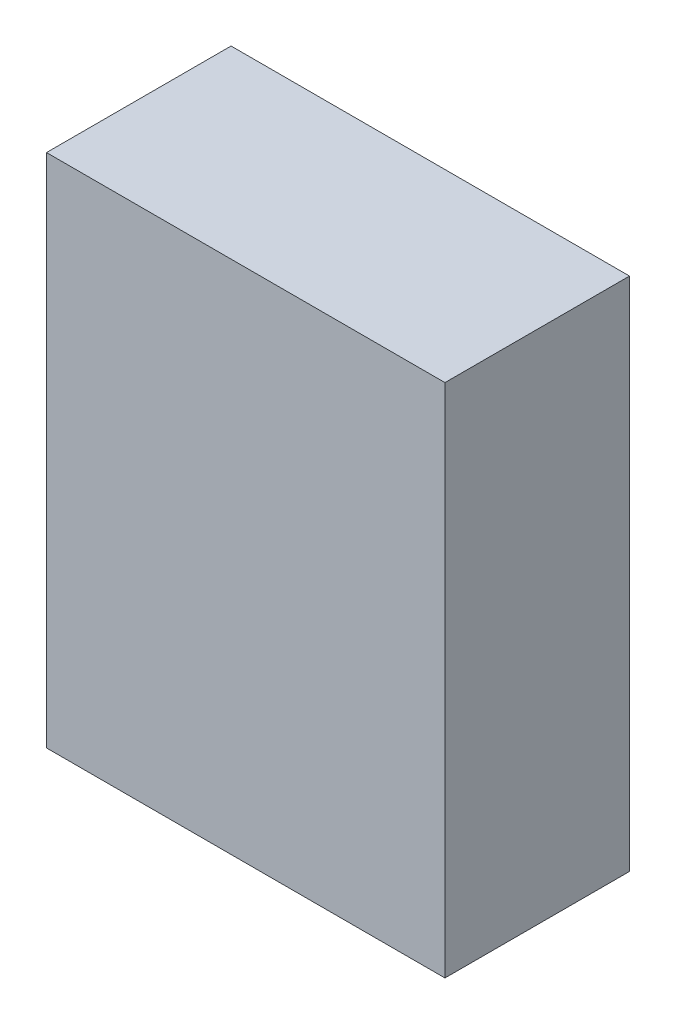
ISO-10303-21;
HEADER;
FILE_DESCRIPTION(('STEP AP214'),'2;1');
FILE_NAME('part.step','',(''),(''),'','','');
FILE_SCHEMA(('AUTOMOTIVE_DESIGN { 1 0 10303 214 1 1 1 1 }'));
ENDSEC;
DATA;
#1=APPLICATION_CONTEXT('core data for automotive mechanical design processes');
#2=APPLICATION_PROTOCOL_DEFINITION('international standard','automotive_design',2000,#1);
#3=PRODUCT_CONTEXT('',#1,'mechanical');
#4=PRODUCT('Part','Part','',(#3));
#5=PRODUCT_RELATED_PRODUCT_CATEGORY('part','',(#4));
#6=PRODUCT_DEFINITION_FORMATION('','',#4);
#7=PRODUCT_DEFINITION_CONTEXT('part definition',#1,'design');
#8=PRODUCT_DEFINITION('design','',#6,#7);
#9=PRODUCT_DEFINITION_SHAPE('','',#8);
#10=(LENGTH_UNIT() NAMED_UNIT(*) SI_UNIT(.MILLI.,.METRE.));
#11=(NAMED_UNIT(*) PLANE_ANGLE_UNIT() SI_UNIT($,.RADIAN.));
#12=(NAMED_UNIT(*) SI_UNIT($,.STERADIAN.) SOLID_ANGLE_UNIT());
#13=UNCERTAINTY_MEASURE_WITH_UNIT(LENGTH_MEASURE(1.E-05),#10,'distance_accuracy_value','');
#14=(GEOMETRIC_REPRESENTATION_CONTEXT(3) GLOBAL_UNCERTAINTY_ASSIGNED_CONTEXT((#13)) GLOBAL_UNIT_ASSIGNED_CONTEXT((#10,
#11,#12)) REPRESENTATION_CONTEXT('',''));
#15=CARTESIAN_POINT('',(0.,0.,0.));
#16=DIRECTION('',(0.,0.,1.));
#17=DIRECTION('',(1.,0.,0.));
#18=AXIS2_PLACEMENT_3D('',#15,#16,#17);
#19=CARTESIAN_POINT('',(0.,0.,0.1999996));
#20=DIRECTION('',(0.,0.,1.));
#21=DIRECTION('',(1.,0.,0.));
#22=AXIS2_PLACEMENT_3D('',#19,#20,#21);
#23=PLANE('',#22);
#24=DIRECTION('',(-1.,0.,0.));
#25=VECTOR('',#24,1.);
#26=CARTESIAN_POINT('',(0.2159,0.2794,0.1999996));
#27=LINE('',#26,#25);
#28=CARTESIAN_POINT('',(0.2159,0.2794,0.1999996));
#29=VERTEX_POINT('',#28);
#30=CARTESIAN_POINT('',(-0.2159,0.2794,0.1999996));
#31=VERTEX_POINT('',#30);
#32=EDGE_CURVE('E81',#29,#31,#27,.T.);
#33=ORIENTED_EDGE('',*,*,#32,.T.);
#34=DIRECTION('',(0.,-1.,0.));
#35=VECTOR('',#34,1.);
#36=CARTESIAN_POINT('',(-0.2159,0.2794,0.1999996));
#37=LINE('',#36,#35);
#38=CARTESIAN_POINT('',(-0.2159,-0.2794,0.1999996));
#39=VERTEX_POINT('',#38);
#40=EDGE_CURVE('E104',#31,#39,#37,.T.);
#41=ORIENTED_EDGE('',*,*,#40,.T.);
#42=DIRECTION('',(1.,0.,0.));
#43=VECTOR('',#42,1.);
#44=CARTESIAN_POINT('',(-0.2159,-0.2794,0.1999996));
#45=LINE('',#44,#43);
#46=CARTESIAN_POINT('',(0.2159,-0.2794,0.1999996));
#47=VERTEX_POINT('',#46);
#48=EDGE_CURVE('E74',#39,#47,#45,.T.);
#49=ORIENTED_EDGE('',*,*,#48,.T.);
#50=DIRECTION('',(0.,1.,0.));
#51=VECTOR('',#50,1.);
#52=CARTESIAN_POINT('',(0.2159,-0.2794,0.1999996));
#53=LINE('',#52,#51);
#54=EDGE_CURVE('E11',#47,#29,#53,.T.);
#55=ORIENTED_EDGE('',*,*,#54,.T.);
#56=EDGE_LOOP('',(#33,#41,#49,#55));
#57=FACE_BOUND('',#56,.T.);
#58=ADVANCED_FACE('F17',(#57),#23,.T.);
#59=CARTESIAN_POINT('',(0.,0.,0.));
#60=DIRECTION('',(0.,0.,1.));
#61=DIRECTION('',(1.,0.,0.));
#62=AXIS2_PLACEMENT_3D('',#59,#60,#61);
#63=PLANE('',#62);
#64=DIRECTION('',(0.,1.,0.));
#65=VECTOR('',#64,1.);
#66=CARTESIAN_POINT('',(0.2159,-0.2794,0.));
#67=LINE('',#66,#65);
#68=CARTESIAN_POINT('',(0.2159,-0.2794,0.));
#69=VERTEX_POINT('',#68);
#70=CARTESIAN_POINT('',(0.2159,0.2794,0.));
#71=VERTEX_POINT('',#70);
#72=EDGE_CURVE('E25',#69,#71,#67,.T.);
#73=ORIENTED_EDGE('',*,*,#72,.F.);
#74=DIRECTION('',(1.,0.,0.));
#75=VECTOR('',#74,1.);
#76=CARTESIAN_POINT('',(-0.2159,-0.2794,0.));
#77=LINE('',#76,#75);
#78=CARTESIAN_POINT('',(-0.2159,-0.2794,0.));
#79=VERTEX_POINT('',#78);
#80=EDGE_CURVE('E108',#79,#69,#77,.T.);
#81=ORIENTED_EDGE('',*,*,#80,.F.);
#82=DIRECTION('',(0.,-1.,0.));
#83=VECTOR('',#82,1.);
#84=CARTESIAN_POINT('',(-0.2159,0.2794,0.));
#85=LINE('',#84,#83);
#86=CARTESIAN_POINT('',(-0.2159,0.2794,0.));
#87=VERTEX_POINT('',#86);
#88=EDGE_CURVE('E83',#87,#79,#85,.T.);
#89=ORIENTED_EDGE('',*,*,#88,.F.);
#90=DIRECTION('',(-1.,0.,0.));
#91=VECTOR('',#90,1.);
#92=CARTESIAN_POINT('',(0.2159,0.2794,0.));
#93=LINE('',#92,#91);
#94=EDGE_CURVE('E79',#71,#87,#93,.T.);
#95=ORIENTED_EDGE('',*,*,#94,.F.);
#96=EDGE_LOOP('',(#73,#81,#89,#95));
#97=FACE_BOUND('',#96,.T.);
#98=ADVANCED_FACE('F85',(#97),#63,.F.);
#99=CARTESIAN_POINT('',(0.2159,-0.2794,0.));
#100=DIRECTION('',(-1.,0.,0.));
#101=DIRECTION('',(0.,0.,1.));
#102=AXIS2_PLACEMENT_3D('',#99,#100,#101);
#103=PLANE('',#102);
#104=ORIENTED_EDGE('',*,*,#72,.T.);
#105=DIRECTION('',(0.,0.,1.));
#106=VECTOR('',#105,1.);
#107=CARTESIAN_POINT('',(0.2159,0.2794,0.));
#108=LINE('',#107,#106);
#109=EDGE_CURVE('E68',#71,#29,#108,.T.);
#110=ORIENTED_EDGE('',*,*,#109,.T.);
#111=ORIENTED_EDGE('',*,*,#54,.F.);
#112=DIRECTION('',(0.,0.,1.));
#113=VECTOR('',#112,1.);
#114=CARTESIAN_POINT('',(0.2159,-0.2794,0.));
#115=LINE('',#114,#113);
#116=EDGE_CURVE('E71',#69,#47,#115,.T.);
#117=ORIENTED_EDGE('',*,*,#116,.F.);
#118=EDGE_LOOP('',(#104,#110,#111,#117));
#119=FACE_BOUND('',#118,.T.);
#120=ADVANCED_FACE('F67',(#119),#103,.F.);
#121=CARTESIAN_POINT('',(-0.2159,-0.2794,0.));
#122=DIRECTION('',(0.,1.,0.));
#123=DIRECTION('',(1.,0.,0.));
#124=AXIS2_PLACEMENT_3D('',#121,#122,#123);
#125=PLANE('',#124);
#126=ORIENTED_EDGE('',*,*,#80,.T.);
#127=ORIENTED_EDGE('',*,*,#116,.T.);
#128=ORIENTED_EDGE('',*,*,#48,.F.);
#129=DIRECTION('',(0.,0.,1.));
#130=VECTOR('',#129,1.);
#131=CARTESIAN_POINT('',(-0.2159,-0.2794,0.));
#132=LINE('',#131,#130);
#133=EDGE_CURVE('E100',#79,#39,#132,.T.);
#134=ORIENTED_EDGE('',*,*,#133,.F.);
#135=EDGE_LOOP('',(#126,#127,#128,#134));
#136=FACE_BOUND('',#135,.T.);
#137=ADVANCED_FACE('F116',(#136),#125,.F.);
#138=CARTESIAN_POINT('',(-0.2159,0.2794,0.));
#139=DIRECTION('',(1.,0.,0.));
#140=DIRECTION('',(0.,1.,0.));
#141=AXIS2_PLACEMENT_3D('',#138,#139,#140);
#142=PLANE('',#141);
#143=ORIENTED_EDGE('',*,*,#88,.T.);
#144=ORIENTED_EDGE('',*,*,#133,.T.);
#145=ORIENTED_EDGE('',*,*,#40,.F.);
#146=DIRECTION('',(0.,0.,1.));
#147=VECTOR('',#146,1.);
#148=CARTESIAN_POINT('',(-0.2159,0.2794,0.));
#149=LINE('',#148,#147);
#150=EDGE_CURVE('E89',#87,#31,#149,.T.);
#151=ORIENTED_EDGE('',*,*,#150,.F.);
#152=EDGE_LOOP('',(#143,#144,#145,#151));
#153=FACE_BOUND('',#152,.T.);
#154=ADVANCED_FACE('F123',(#153),#142,.F.);
#155=CARTESIAN_POINT('',(0.2159,0.2794,0.));
#156=DIRECTION('',(0.,-1.,0.));
#157=DIRECTION('',(0.,0.,-1.));
#158=AXIS2_PLACEMENT_3D('',#155,#156,#157);
#159=PLANE('',#158);
#160=ORIENTED_EDGE('',*,*,#94,.T.);
#161=ORIENTED_EDGE('',*,*,#150,.T.);
#162=ORIENTED_EDGE('',*,*,#32,.F.);
#163=ORIENTED_EDGE('',*,*,#109,.F.);
#164=EDGE_LOOP('',(#160,#161,#162,#163));
#165=FACE_BOUND('',#164,.T.);
#166=ADVANCED_FACE('F77',(#165),#159,.F.);
#167=CLOSED_SHELL('',(#58,#98,#120,#137,#154,#166));
#168=MANIFOLD_SOLID_BREP('B1',#167);
#169=ADVANCED_BREP_SHAPE_REPRESENTATION('',(#18,#168),#14);
#170=SHAPE_DEFINITION_REPRESENTATION(#9,#169);
ENDSEC;
END-ISO-10303-21;
